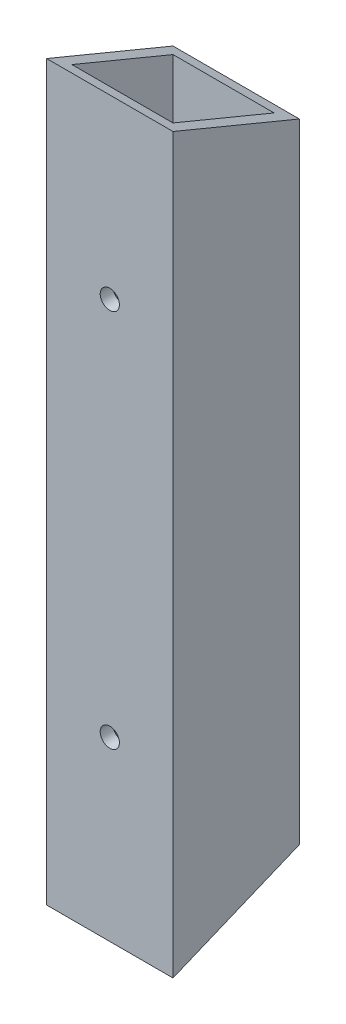
ISO-10303-21;
HEADER;
FILE_DESCRIPTION(('STEP AP214'),'2;1');
FILE_NAME('part.step','',(''),(''),'','','');
FILE_SCHEMA(('AUTOMOTIVE_DESIGN { 1 0 10303 214 1 1 1 1 }'));
ENDSEC;
DATA;
#1=APPLICATION_CONTEXT('core data for automotive mechanical design processes');
#2=APPLICATION_PROTOCOL_DEFINITION('international standard','automotive_design',2000,#1);
#3=PRODUCT_CONTEXT('',#1,'mechanical');
#4=PRODUCT('Part','Part','',(#3));
#5=PRODUCT_RELATED_PRODUCT_CATEGORY('part','',(#4));
#6=PRODUCT_DEFINITION_FORMATION('','',#4);
#7=PRODUCT_DEFINITION_CONTEXT('part definition',#1,'design');
#8=PRODUCT_DEFINITION('design','',#6,#7);
#9=PRODUCT_DEFINITION_SHAPE('','',#8);
#10=(LENGTH_UNIT() NAMED_UNIT(*) SI_UNIT(.MILLI.,.METRE.));
#11=(NAMED_UNIT(*) PLANE_ANGLE_UNIT() SI_UNIT($,.RADIAN.));
#12=(NAMED_UNIT(*) SI_UNIT($,.STERADIAN.) SOLID_ANGLE_UNIT());
#13=UNCERTAINTY_MEASURE_WITH_UNIT(LENGTH_MEASURE(1.E-05),#10,'distance_accuracy_value','');
#14=(GEOMETRIC_REPRESENTATION_CONTEXT(3) GLOBAL_UNCERTAINTY_ASSIGNED_CONTEXT((#13)) GLOBAL_UNIT_ASSIGNED_CONTEXT((#10,
#11,#12)) REPRESENTATION_CONTEXT('',''));
#15=CARTESIAN_POINT('',(0.,0.,0.));
#16=DIRECTION('',(0.,0.,1.));
#17=DIRECTION('',(1.,0.,0.));
#18=AXIS2_PLACEMENT_3D('',#15,#16,#17);
#19=CARTESIAN_POINT('',(15.875,44.45,0.));
#20=DIRECTION('',(0.,0.,1.));
#21=DIRECTION('',(1.,0.,0.));
#22=AXIS2_PLACEMENT_3D('',#19,#20,#21);
#23=CYLINDRICAL_SURFACE('',#22,2.413);
#24=CARTESIAN_POINT('',(15.875,44.45,-28.575));
#25=DIRECTION('',(0.,0.,1.));
#26=DIRECTION('',(1.,0.,0.));
#27=AXIS2_PLACEMENT_3D('',#24,#25,#26);
#28=CIRCLE('',#27,2.413);
#29=CARTESIAN_POINT('',(18.288,44.45,-28.575));
#30=VERTEX_POINT('',#29);
#31=EDGE_CURVE('E124',#30,#30,#28,.F.);
#32=ORIENTED_EDGE('',*,*,#31,.F.);
#33=EDGE_LOOP('',(#32));
#34=FACE_BOUND('',#33,.T.);
#35=CARTESIAN_POINT('',(15.875,44.45,-31.75));
#36=DIRECTION('',(0.,0.,1.));
#37=DIRECTION('',(1.,0.,0.));
#38=AXIS2_PLACEMENT_3D('',#35,#36,#37);
#39=CIRCLE('',#38,2.413);
#40=CARTESIAN_POINT('',(18.288,44.45,-31.75));
#41=VERTEX_POINT('',#40);
#42=EDGE_CURVE('E20',#41,#41,#39,.T.);
#43=ORIENTED_EDGE('',*,*,#42,.F.);
#44=EDGE_LOOP('',(#43));
#45=FACE_BOUND('',#44,.T.);
#46=ADVANCED_FACE('F17',(#34,#45),#23,.F.);
#47=CARTESIAN_POINT('',(15.875,139.7,0.));
#48=DIRECTION('',(0.,0.,1.));
#49=DIRECTION('',(1.,0.,0.));
#50=AXIS2_PLACEMENT_3D('',#47,#48,#49);
#51=CYLINDRICAL_SURFACE('',#50,2.413);
#52=CARTESIAN_POINT('',(15.875,139.7,-28.575));
#53=DIRECTION('',(0.,0.,1.));
#54=DIRECTION('',(1.,0.,0.));
#55=AXIS2_PLACEMENT_3D('',#52,#53,#54);
#56=CIRCLE('',#55,2.413);
#57=CARTESIAN_POINT('',(18.288,139.7,-28.575));
#58=VERTEX_POINT('',#57);
#59=EDGE_CURVE('E123',#58,#58,#56,.F.);
#60=ORIENTED_EDGE('',*,*,#59,.F.);
#61=EDGE_LOOP('',(#60));
#62=FACE_BOUND('',#61,.T.);
#63=CARTESIAN_POINT('',(15.875,139.7,-31.75));
#64=DIRECTION('',(0.,0.,1.));
#65=DIRECTION('',(1.,0.,0.));
#66=AXIS2_PLACEMENT_3D('',#63,#64,#65);
#67=CIRCLE('',#66,2.413);
#68=CARTESIAN_POINT('',(18.288,139.7,-31.75));
#69=VERTEX_POINT('',#68);
#70=EDGE_CURVE('E125',#69,#69,#67,.T.);
#71=ORIENTED_EDGE('',*,*,#70,.F.);
#72=EDGE_LOOP('',(#71));
#73=FACE_BOUND('',#72,.T.);
#74=ADVANCED_FACE('F150',(#62,#73),#51,.F.);
#75=CARTESIAN_POINT('',(31.75,0.,-31.75));
#76=DIRECTION('',(0.,0.,-1.));
#77=DIRECTION('',(-1.,0.,0.));
#78=AXIS2_PLACEMENT_3D('',#75,#76,#77);
#79=PLANE('',#78);
#80=ORIENTED_EDGE('',*,*,#70,.T.);
#81=EDGE_LOOP('',(#80));
#82=FACE_BOUND('',#81,.T.);
#83=ORIENTED_EDGE('',*,*,#42,.T.);
#84=EDGE_LOOP('',(#83));
#85=FACE_BOUND('',#84,.T.);
#86=DIRECTION('',(0.,1.,0.));
#87=VECTOR('',#86,1.);
#88=CARTESIAN_POINT('',(0.,0.,-31.75));
#89=LINE('',#88,#87);
#90=CARTESIAN_POINT('',(0.,170.998719394662,-31.7499999999992));
#91=VERTEX_POINT('',#90);
#92=CARTESIAN_POINT('',(0.,13.1512806053466,-31.75));
#93=VERTEX_POINT('',#92);
#94=EDGE_CURVE('E117',#91,#93,#89,.F.);
#95=ORIENTED_EDGE('',*,*,#94,.F.);
#96=DIRECTION('',(1.,0.,0.));
#97=VECTOR('',#96,1.);
#98=CARTESIAN_POINT('',(31.75,170.998719394655,-31.7499999999966));
#99=LINE('',#98,#97);
#100=CARTESIAN_POINT('',(31.75,170.998719394662,-31.7499999999992));
#101=VERTEX_POINT('',#100);
#102=EDGE_CURVE('E303',#91,#101,#99,.T.);
#103=ORIENTED_EDGE('',*,*,#102,.T.);
#104=DIRECTION('',(0.,1.,0.));
#105=VECTOR('',#104,1.);
#106=CARTESIAN_POINT('',(31.75,0.,-31.75));
#107=LINE('',#106,#105);
#108=CARTESIAN_POINT('',(31.75,13.1512806053466,-31.75));
#109=VERTEX_POINT('',#108);
#110=EDGE_CURVE('E308',#109,#101,#107,.T.);
#111=ORIENTED_EDGE('',*,*,#110,.F.);
#112=DIRECTION('',(1.,0.,0.));
#113=VECTOR('',#112,1.);
#114=CARTESIAN_POINT('',(31.75,13.1512806053466,-31.75));
#115=LINE('',#114,#113);
#116=EDGE_CURVE('E91',#109,#93,#115,.F.);
#117=ORIENTED_EDGE('',*,*,#116,.T.);
#118=EDGE_LOOP('',(#95,#103,#111,#117));
#119=FACE_BOUND('',#118,.T.);
#120=ADVANCED_FACE('F146',(#82,#85,#119),#79,.T.);
#121=CARTESIAN_POINT('',(28.575,0.,-28.575));
#122=DIRECTION('',(-1.,0.,0.));
#123=DIRECTION('',(0.,0.,1.));
#124=AXIS2_PLACEMENT_3D('',#121,#122,#123);
#125=PLANE('',#124);
#126=DIRECTION('',(0.,1.,0.));
#127=VECTOR('',#126,1.);
#128=CARTESIAN_POINT('',(28.575,0.,-3.175));
#129=LINE('',#128,#127);
#130=CARTESIAN_POINT('',(28.575,182.834871939458,-3.17500000000082));
#131=VERTEX_POINT('',#130);
#132=CARTESIAN_POINT('',(28.575,1.31512806053478,-3.17499999999995));
#133=VERTEX_POINT('',#132);
#134=EDGE_CURVE('E82',#131,#133,#129,.F.);
#135=ORIENTED_EDGE('',*,*,#134,.F.);
#136=DIRECTION('',(0.,-0.382683432365094,-0.923879532511285));
#137=VECTOR('',#136,1.);
#138=CARTESIAN_POINT('',(28.575,184.15,0.));
#139=LINE('',#138,#137);
#140=CARTESIAN_POINT('',(28.575,172.313847455183,-28.5750000000006));
#141=VERTEX_POINT('',#140);
#142=EDGE_CURVE('E295',#131,#141,#139,.T.);
#143=ORIENTED_EDGE('',*,*,#142,.T.);
#144=DIRECTION('',(0.,1.,0.));
#145=VECTOR('',#144,1.);
#146=CARTESIAN_POINT('',(28.575,0.,-28.575));
#147=LINE('',#146,#145);
#148=CARTESIAN_POINT('',(28.575,11.8361525448107,-28.5749999999999));
#149=VERTEX_POINT('',#148);
#150=EDGE_CURVE('E85',#149,#141,#147,.T.);
#151=ORIENTED_EDGE('',*,*,#150,.F.);
#152=DIRECTION('',(0.,-0.382683432365094,0.923879532511285));
#153=VECTOR('',#152,1.);
#154=CARTESIAN_POINT('',(28.575,13.1512806053466,-31.75));
#155=LINE('',#154,#153);
#156=EDGE_CURVE('E79',#149,#133,#155,.T.);
#157=ORIENTED_EDGE('',*,*,#156,.T.);
#158=EDGE_LOOP('',(#135,#143,#151,#157));
#159=FACE_BOUND('',#158,.T.);
#160=ADVANCED_FACE('F81',(#159),#125,.T.);
#161=CARTESIAN_POINT('',(3.175,0.,-28.575));
#162=DIRECTION('',(0.,0.,1.));
#163=DIRECTION('',(1.,0.,0.));
#164=AXIS2_PLACEMENT_3D('',#161,#162,#163);
#165=PLANE('',#164);
#166=ORIENTED_EDGE('',*,*,#59,.T.);
#167=EDGE_LOOP('',(#166));
#168=FACE_BOUND('',#167,.T.);
#169=ORIENTED_EDGE('',*,*,#31,.T.);
#170=EDGE_LOOP('',(#169));
#171=FACE_BOUND('',#170,.T.);
#172=ORIENTED_EDGE('',*,*,#150,.T.);
#173=DIRECTION('',(1.,0.,0.));
#174=VECTOR('',#173,1.);
#175=CARTESIAN_POINT('',(31.75,172.313847455188,-28.5750000000024));
#176=LINE('',#175,#174);
#177=CARTESIAN_POINT('',(3.175,172.313847455183,-28.5750000000006));
#178=VERTEX_POINT('',#177);
#179=EDGE_CURVE('E292',#141,#178,#176,.F.);
#180=ORIENTED_EDGE('',*,*,#179,.T.);
#181=DIRECTION('',(0.,1.,0.));
#182=VECTOR('',#181,1.);
#183=CARTESIAN_POINT('',(3.175,0.,-28.575));
#184=LINE('',#183,#182);
#185=CARTESIAN_POINT('',(3.175,11.8361525448107,-28.5749999999999));
#186=VERTEX_POINT('',#185);
#187=EDGE_CURVE('E102',#186,#178,#184,.T.);
#188=ORIENTED_EDGE('',*,*,#187,.F.);
#189=DIRECTION('',(1.,0.,0.));
#190=VECTOR('',#189,1.);
#191=CARTESIAN_POINT('',(31.75,11.8361525448117,-28.5749999999994));
#192=LINE('',#191,#190);
#193=EDGE_CURVE('E109',#186,#149,#192,.T.);
#194=ORIENTED_EDGE('',*,*,#193,.T.);
#195=EDGE_LOOP('',(#172,#180,#188,#194));
#196=FACE_BOUND('',#195,.T.);
#197=ADVANCED_FACE('F193',(#168,#171,#196),#165,.T.);
#198=CARTESIAN_POINT('',(3.175,0.,-3.175));
#199=DIRECTION('',(1.,0.,0.));
#200=DIRECTION('',(0.,0.,-1.));
#201=AXIS2_PLACEMENT_3D('',#198,#199,#200);
#202=PLANE('',#201);
#203=ORIENTED_EDGE('',*,*,#187,.T.);
#204=DIRECTION('',(0.,-0.382683432365094,-0.923879532511285));
#205=VECTOR('',#204,1.);
#206=CARTESIAN_POINT('',(3.175,184.15,0.));
#207=LINE('',#206,#205);
#208=CARTESIAN_POINT('',(3.175,182.834871939458,-3.17500000000081));
#209=VERTEX_POINT('',#208);
#210=EDGE_CURVE('E296',#178,#209,#207,.F.);
#211=ORIENTED_EDGE('',*,*,#210,.T.);
#212=DIRECTION('',(0.,1.,0.));
#213=VECTOR('',#212,1.);
#214=CARTESIAN_POINT('',(3.175,0.,-3.175));
#215=LINE('',#214,#213);
#216=CARTESIAN_POINT('',(3.175,1.31512806053478,-3.17499999999995));
#217=VERTEX_POINT('',#216);
#218=EDGE_CURVE('E101',#217,#209,#215,.T.);
#219=ORIENTED_EDGE('',*,*,#218,.F.);
#220=DIRECTION('',(0.,-0.382683432365094,0.923879532511285));
#221=VECTOR('',#220,1.);
#222=CARTESIAN_POINT('',(3.175,13.1512806053466,-31.75));
#223=LINE('',#222,#221);
#224=EDGE_CURVE('E107',#217,#186,#223,.F.);
#225=ORIENTED_EDGE('',*,*,#224,.T.);
#226=EDGE_LOOP('',(#203,#211,#219,#225));
#227=FACE_BOUND('',#226,.T.);
#228=ADVANCED_FACE('F189',(#227),#202,.T.);
#229=CARTESIAN_POINT('',(28.575,0.,-3.175));
#230=DIRECTION('',(0.,0.,-1.));
#231=DIRECTION('',(-1.,0.,0.));
#232=AXIS2_PLACEMENT_3D('',#229,#230,#231);
#233=PLANE('',#232);
#234=CARTESIAN_POINT('',(15.875,139.7,-3.175));
#235=DIRECTION('',(0.,0.,1.));
#236=DIRECTION('',(1.,0.,0.));
#237=AXIS2_PLACEMENT_3D('',#234,#235,#236);
#238=CIRCLE('',#237,2.413);
#239=CARTESIAN_POINT('',(18.288,139.7,-3.175));
#240=VERTEX_POINT('',#239);
#241=EDGE_CURVE('E130',#240,#240,#238,.T.);
#242=ORIENTED_EDGE('',*,*,#241,.T.);
#243=EDGE_LOOP('',(#242));
#244=FACE_BOUND('',#243,.T.);
#245=CARTESIAN_POINT('',(15.875,44.45,-3.175));
#246=DIRECTION('',(0.,0.,1.));
#247=DIRECTION('',(1.,0.,0.));
#248=AXIS2_PLACEMENT_3D('',#245,#246,#247);
#249=CIRCLE('',#248,2.413);
#250=CARTESIAN_POINT('',(18.288,44.45,-3.175));
#251=VERTEX_POINT('',#250);
#252=EDGE_CURVE('E134',#251,#251,#249,.T.);
#253=ORIENTED_EDGE('',*,*,#252,.T.);
#254=EDGE_LOOP('',(#253));
#255=FACE_BOUND('',#254,.T.);
#256=ORIENTED_EDGE('',*,*,#218,.T.);
#257=DIRECTION('',(1.,0.,0.));
#258=VECTOR('',#257,1.);
#259=CARTESIAN_POINT('',(31.75,182.834871939464,-3.17500000000325));
#260=LINE('',#259,#258);
#261=EDGE_CURVE('E99',#209,#131,#260,.T.);
#262=ORIENTED_EDGE('',*,*,#261,.T.);
#263=ORIENTED_EDGE('',*,*,#134,.T.);
#264=DIRECTION('',(1.,0.,0.));
#265=VECTOR('',#264,1.);
#266=CARTESIAN_POINT('',(31.75,1.31512806053514,-3.1749999999998));
#267=LINE('',#266,#265);
#268=EDGE_CURVE('E90',#133,#217,#267,.F.);
#269=ORIENTED_EDGE('',*,*,#268,.T.);
#270=EDGE_LOOP('',(#256,#262,#263,#269));
#271=FACE_BOUND('',#270,.T.);
#272=ADVANCED_FACE('F96',(#244,#255,#271),#233,.T.);
#273=CARTESIAN_POINT('',(0.,0.,-31.75));
#274=DIRECTION('',(-1.,0.,0.));
#275=DIRECTION('',(0.,0.,1.));
#276=AXIS2_PLACEMENT_3D('',#273,#274,#275);
#277=PLANE('',#276);
#278=DIRECTION('',(0.,1.,0.));
#279=VECTOR('',#278,1.);
#280=CARTESIAN_POINT('',(0.,0.,0.));
#281=LINE('',#280,#279);
#282=CARTESIAN_POINT('',(0.,184.15,0.));
#283=VERTEX_POINT('',#282);
#284=CARTESIAN_POINT('',(0.,1.34007388519208E-13,0.));
#285=VERTEX_POINT('',#284);
#286=EDGE_CURVE('E133',#283,#285,#281,.F.);
#287=ORIENTED_EDGE('',*,*,#286,.F.);
#288=DIRECTION('',(0.,-0.382683432365094,-0.923879532511285));
#289=VECTOR('',#288,1.);
#290=CARTESIAN_POINT('',(0.,184.15,0.));
#291=LINE('',#290,#289);
#292=EDGE_CURVE('E305',#283,#91,#291,.T.);
#293=ORIENTED_EDGE('',*,*,#292,.T.);
#294=ORIENTED_EDGE('',*,*,#94,.T.);
#295=DIRECTION('',(0.,-0.382683432365094,0.923879532511285));
#296=VECTOR('',#295,1.);
#297=CARTESIAN_POINT('',(0.,13.1512806053466,-31.75));
#298=LINE('',#297,#296);
#299=EDGE_CURVE('E115',#93,#285,#298,.T.);
#300=ORIENTED_EDGE('',*,*,#299,.T.);
#301=EDGE_LOOP('',(#287,#293,#294,#300));
#302=FACE_BOUND('',#301,.T.);
#303=ADVANCED_FACE('F183',(#302),#277,.T.);
#304=CARTESIAN_POINT('',(31.75,13.1512806053466,-31.75));
#305=DIRECTION('',(0.,0.923879532511285,0.382683432365094));
#306=DIRECTION('',(0.,-0.382683432365094,0.923879532511285));
#307=AXIS2_PLACEMENT_3D('',#304,#305,#306);
#308=PLANE('',#307);
#309=ORIENTED_EDGE('',*,*,#224,.F.);
#310=ORIENTED_EDGE('',*,*,#268,.F.);
#311=ORIENTED_EDGE('',*,*,#156,.F.);
#312=ORIENTED_EDGE('',*,*,#193,.F.);
#313=EDGE_LOOP('',(#309,#310,#311,#312));
#314=FACE_BOUND('',#313,.T.);
#315=DIRECTION('',(0.,0.382683432365109,-0.923879532511279));
#316=VECTOR('',#315,1.);
#317=CARTESIAN_POINT('',(31.75,0.,0.));
#318=LINE('',#317,#316);
#319=CARTESIAN_POINT('',(31.75,2.68014777038417E-13,1.11022302462516E-13));
#320=VERTEX_POINT('',#319);
#321=EDGE_CURVE('E310',#320,#109,#318,.T.);
#322=ORIENTED_EDGE('',*,*,#321,.F.);
#323=DIRECTION('',(1.,0.,0.));
#324=VECTOR('',#323,1.);
#325=CARTESIAN_POINT('',(0.,0.,0.));
#326=LINE('',#325,#324);
#327=EDGE_CURVE('E318',#285,#320,#326,.T.);
#328=ORIENTED_EDGE('',*,*,#327,.F.);
#329=ORIENTED_EDGE('',*,*,#299,.F.);
#330=ORIENTED_EDGE('',*,*,#116,.F.);
#331=EDGE_LOOP('',(#322,#328,#329,#330));
#332=FACE_BOUND('',#331,.T.);
#333=ADVANCED_FACE('F104',(#314,#332),#308,.F.);
#334=CARTESIAN_POINT('',(31.75,0.,0.));
#335=DIRECTION('',(1.,0.,0.));
#336=DIRECTION('',(0.,0.,-1.));
#337=AXIS2_PLACEMENT_3D('',#334,#335,#336);
#338=PLANE('',#337);
#339=ORIENTED_EDGE('',*,*,#110,.T.);
#340=DIRECTION('',(0.,-0.382683432365094,-0.923879532511285));
#341=VECTOR('',#340,1.);
#342=CARTESIAN_POINT('',(31.75,184.15,0.));
#343=LINE('',#342,#341);
#344=CARTESIAN_POINT('',(31.75,184.15,0.));
#345=VERTEX_POINT('',#344);
#346=EDGE_CURVE('E35',#101,#345,#343,.F.);
#347=ORIENTED_EDGE('',*,*,#346,.T.);
#348=DIRECTION('',(0.,1.,0.));
#349=VECTOR('',#348,1.);
#350=CARTESIAN_POINT('',(31.75,0.,0.));
#351=LINE('',#350,#349);
#352=EDGE_CURVE('E314',#320,#345,#351,.T.);
#353=ORIENTED_EDGE('',*,*,#352,.F.);
#354=ORIENTED_EDGE('',*,*,#321,.T.);
#355=EDGE_LOOP('',(#339,#347,#353,#354));
#356=FACE_BOUND('',#355,.T.);
#357=ADVANCED_FACE('F177',(#356),#338,.T.);
#358=CARTESIAN_POINT('',(31.75,184.15,0.));
#359=DIRECTION('',(0.,-0.923879532511285,0.382683432365094));
#360=DIRECTION('',(0.,-0.382683432365094,-0.923879532511285));
#361=AXIS2_PLACEMENT_3D('',#358,#359,#360);
#362=PLANE('',#361);
#363=ORIENTED_EDGE('',*,*,#210,.F.);
#364=ORIENTED_EDGE('',*,*,#179,.F.);
#365=ORIENTED_EDGE('',*,*,#142,.F.);
#366=ORIENTED_EDGE('',*,*,#261,.F.);
#367=EDGE_LOOP('',(#363,#364,#365,#366));
#368=FACE_BOUND('',#367,.T.);
#369=ORIENTED_EDGE('',*,*,#346,.F.);
#370=ORIENTED_EDGE('',*,*,#102,.F.);
#371=ORIENTED_EDGE('',*,*,#292,.F.);
#372=DIRECTION('',(1.,0.,0.));
#373=VECTOR('',#372,1.);
#374=CARTESIAN_POINT('',(0.,184.15,0.));
#375=LINE('',#374,#373);
#376=EDGE_CURVE('E129',#345,#283,#375,.F.);
#377=ORIENTED_EDGE('',*,*,#376,.F.);
#378=EDGE_LOOP('',(#369,#370,#371,#377));
#379=FACE_BOUND('',#378,.T.);
#380=ADVANCED_FACE('F173',(#368,#379),#362,.F.);
#381=CARTESIAN_POINT('',(15.875,44.45,0.));
#382=DIRECTION('',(0.,0.,1.));
#383=DIRECTION('',(1.,0.,0.));
#384=AXIS2_PLACEMENT_3D('',#381,#382,#383);
#385=CYLINDRICAL_SURFACE('',#384,2.413);
#386=ORIENTED_EDGE('',*,*,#252,.F.);
#387=EDGE_LOOP('',(#386));
#388=FACE_BOUND('',#387,.T.);
#389=CARTESIAN_POINT('',(15.875,44.45,0.));
#390=DIRECTION('',(0.,0.,1.));
#391=DIRECTION('',(1.,0.,0.));
#392=AXIS2_PLACEMENT_3D('',#389,#390,#391);
#393=CIRCLE('',#392,2.413);
#394=CARTESIAN_POINT('',(18.288,44.45,0.));
#395=VERTEX_POINT('',#394);
#396=EDGE_CURVE('E26',#395,#395,#393,.F.);
#397=ORIENTED_EDGE('',*,*,#396,.F.);
#398=EDGE_LOOP('',(#397));
#399=FACE_BOUND('',#398,.T.);
#400=ADVANCED_FACE('F166',(#388,#399),#385,.F.);
#401=CARTESIAN_POINT('',(15.875,139.7,0.));
#402=DIRECTION('',(0.,0.,1.));
#403=DIRECTION('',(1.,0.,0.));
#404=AXIS2_PLACEMENT_3D('',#401,#402,#403);
#405=CYLINDRICAL_SURFACE('',#404,2.413);
#406=ORIENTED_EDGE('',*,*,#241,.F.);
#407=EDGE_LOOP('',(#406));
#408=FACE_BOUND('',#407,.T.);
#409=CARTESIAN_POINT('',(15.875,139.7,0.));
#410=DIRECTION('',(0.,0.,1.));
#411=DIRECTION('',(1.,0.,0.));
#412=AXIS2_PLACEMENT_3D('',#409,#410,#411);
#413=CIRCLE('',#412,2.413);
#414=CARTESIAN_POINT('',(18.288,139.7,0.));
#415=VERTEX_POINT('',#414);
#416=EDGE_CURVE('E11',#415,#415,#413,.F.);
#417=ORIENTED_EDGE('',*,*,#416,.F.);
#418=EDGE_LOOP('',(#417));
#419=FACE_BOUND('',#418,.T.);
#420=ADVANCED_FACE('F160',(#408,#419),#405,.F.);
#421=CARTESIAN_POINT('',(0.,0.,0.));
#422=DIRECTION('',(0.,0.,1.));
#423=DIRECTION('',(1.,0.,0.));
#424=AXIS2_PLACEMENT_3D('',#421,#422,#423);
#425=PLANE('',#424);
#426=ORIENTED_EDGE('',*,*,#416,.T.);
#427=EDGE_LOOP('',(#426));
#428=FACE_BOUND('',#427,.T.);
#429=ORIENTED_EDGE('',*,*,#396,.T.);
#430=EDGE_LOOP('',(#429));
#431=FACE_BOUND('',#430,.T.);
#432=ORIENTED_EDGE('',*,*,#352,.T.);
#433=ORIENTED_EDGE('',*,*,#376,.T.);
#434=ORIENTED_EDGE('',*,*,#286,.T.);
#435=ORIENTED_EDGE('',*,*,#327,.T.);
#436=EDGE_LOOP('',(#432,#433,#434,#435));
#437=FACE_BOUND('',#436,.T.);
#438=ADVANCED_FACE('F158',(#428,#431,#437),#425,.T.);
#439=CLOSED_SHELL('',(#46,#74,#120,#160,#197,#228,#272,#303,#333,#357,#380,#400,#420,#438));
#440=MANIFOLD_SOLID_BREP('B1',#439);
#441=ADVANCED_BREP_SHAPE_REPRESENTATION('',(#18,#440),#14);
#442=SHAPE_DEFINITION_REPRESENTATION(#9,#441);
ENDSEC;
END-ISO-10303-21;
